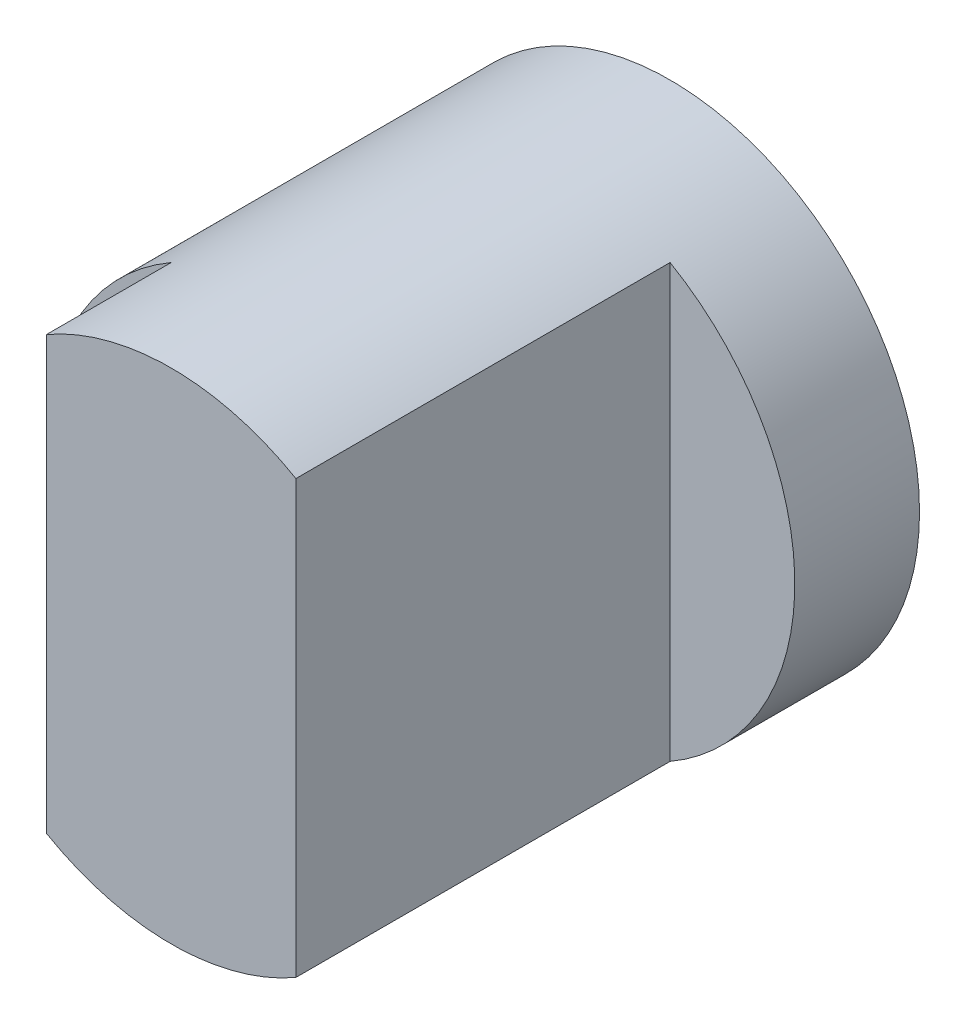
ISO-10303-21;
HEADER;
FILE_DESCRIPTION(('STEP AP214'),'2;1');
FILE_NAME('part.step','',(''),(''),'','','');
FILE_SCHEMA(('AUTOMOTIVE_DESIGN { 1 0 10303 214 1 1 1 1 }'));
ENDSEC;
DATA;
#1=APPLICATION_CONTEXT('core data for automotive mechanical design processes');
#2=APPLICATION_PROTOCOL_DEFINITION('international standard','automotive_design',2000,#1);
#3=PRODUCT_CONTEXT('',#1,'mechanical');
#4=PRODUCT('Part','Part','',(#3));
#5=PRODUCT_RELATED_PRODUCT_CATEGORY('part','',(#4));
#6=PRODUCT_DEFINITION_FORMATION('','',#4);
#7=PRODUCT_DEFINITION_CONTEXT('part definition',#1,'design');
#8=PRODUCT_DEFINITION('design','',#6,#7);
#9=PRODUCT_DEFINITION_SHAPE('','',#8);
#10=(LENGTH_UNIT() NAMED_UNIT(*) SI_UNIT(.MILLI.,.METRE.));
#11=(NAMED_UNIT(*) PLANE_ANGLE_UNIT() SI_UNIT($,.RADIAN.));
#12=(NAMED_UNIT(*) SI_UNIT($,.STERADIAN.) SOLID_ANGLE_UNIT());
#13=UNCERTAINTY_MEASURE_WITH_UNIT(LENGTH_MEASURE(1.E-05),#10,'distance_accuracy_value','');
#14=(GEOMETRIC_REPRESENTATION_CONTEXT(3) GLOBAL_UNCERTAINTY_ASSIGNED_CONTEXT((#13)) GLOBAL_UNIT_ASSIGNED_CONTEXT((#10,
#11,#12)) REPRESENTATION_CONTEXT('',''));
#15=CARTESIAN_POINT('',(0.,0.,0.));
#16=DIRECTION('',(0.,0.,1.));
#17=DIRECTION('',(1.,0.,0.));
#18=AXIS2_PLACEMENT_3D('',#15,#16,#17);
#19=CARTESIAN_POINT('',(0.,0.,4.));
#20=DIRECTION('',(0.,0.,-1.));
#21=DIRECTION('',(-1.,0.,0.));
#22=AXIS2_PLACEMENT_3D('',#19,#20,#21);
#23=CYLINDRICAL_SURFACE('',#22,2.);
#24=CARTESIAN_POINT('',(0.,0.,4.));
#25=DIRECTION('',(0.,0.,1.));
#26=DIRECTION('',(1.,0.,0.));
#27=AXIS2_PLACEMENT_3D('',#24,#25,#26);
#28=CIRCLE('',#27,2.);
#29=CARTESIAN_POINT('',(1.,1.73205080756888,4.));
#30=VERTEX_POINT('',#29);
#31=CARTESIAN_POINT('',(-1.,1.73205080756888,4.));
#32=VERTEX_POINT('',#31);
#33=EDGE_CURVE('E82',#30,#32,#28,.T.);
#34=ORIENTED_EDGE('',*,*,#33,.F.);
#35=DIRECTION('',(0.,0.,-1.));
#36=VECTOR('',#35,1.);
#37=CARTESIAN_POINT('',(1.,1.73205080756888,4.));
#38=LINE('',#37,#36);
#39=CARTESIAN_POINT('',(1.,1.73205080756888,1.));
#40=VERTEX_POINT('',#39);
#41=EDGE_CURVE('E55',#30,#40,#38,.T.);
#42=ORIENTED_EDGE('',*,*,#41,.T.);
#43=CARTESIAN_POINT('',(0.,0.,1.));
#44=DIRECTION('',(0.,0.,-1.));
#45=DIRECTION('',(-1.,0.,0.));
#46=AXIS2_PLACEMENT_3D('',#43,#44,#45);
#47=CIRCLE('',#46,2.);
#48=CARTESIAN_POINT('',(1.,-1.73205080756888,1.));
#49=VERTEX_POINT('',#48);
#50=EDGE_CURVE('E11',#40,#49,#47,.T.);
#51=ORIENTED_EDGE('',*,*,#50,.T.);
#52=DIRECTION('',(0.,0.,-1.));
#53=VECTOR('',#52,1.);
#54=CARTESIAN_POINT('',(1.,-1.73205080756888,4.));
#55=LINE('',#54,#53);
#56=CARTESIAN_POINT('',(1.,-1.73205080756888,4.));
#57=VERTEX_POINT('',#56);
#58=EDGE_CURVE('E101',#49,#57,#55,.F.);
#59=ORIENTED_EDGE('',*,*,#58,.T.);
#60=CARTESIAN_POINT('',(-1.,-1.73205080756888,4.));
#61=VERTEX_POINT('',#60);
#62=EDGE_CURVE('E91',#61,#57,#28,.T.);
#63=ORIENTED_EDGE('',*,*,#62,.F.);
#64=DIRECTION('',(0.,0.,-1.));
#65=VECTOR('',#64,1.);
#66=CARTESIAN_POINT('',(-1.,-1.73205080756888,4.));
#67=LINE('',#66,#65);
#68=CARTESIAN_POINT('',(-1.,-1.73205080756888,3.));
#69=VERTEX_POINT('',#68);
#70=EDGE_CURVE('E47',#61,#69,#67,.T.);
#71=ORIENTED_EDGE('',*,*,#70,.T.);
#72=CARTESIAN_POINT('',(0.,0.,3.));
#73=DIRECTION('',(0.,0.,-1.));
#74=DIRECTION('',(-1.,0.,0.));
#75=AXIS2_PLACEMENT_3D('',#72,#73,#74);
#76=CIRCLE('',#75,2.);
#77=CARTESIAN_POINT('',(-1.,1.73205080756888,3.));
#78=VERTEX_POINT('',#77);
#79=EDGE_CURVE('E40',#69,#78,#76,.T.);
#80=ORIENTED_EDGE('',*,*,#79,.T.);
#81=DIRECTION('',(0.,0.,-1.));
#82=VECTOR('',#81,1.);
#83=CARTESIAN_POINT('',(-1.,1.73205080756888,4.));
#84=LINE('',#83,#82);
#85=EDGE_CURVE('E75',#78,#32,#84,.F.);
#86=ORIENTED_EDGE('',*,*,#85,.T.);
#87=EDGE_LOOP('',(#34,#42,#51,#59,#63,#71,#80,#86));
#88=FACE_BOUND('',#87,.T.);
#89=CARTESIAN_POINT('',(0.,0.,0.));
#90=DIRECTION('',(0.,0.,1.));
#91=DIRECTION('',(1.,0.,0.));
#92=AXIS2_PLACEMENT_3D('',#89,#90,#91);
#93=CIRCLE('',#92,2.);
#94=CARTESIAN_POINT('',(2.,0.,0.));
#95=VERTEX_POINT('',#94);
#96=EDGE_CURVE('E93',#95,#95,#93,.T.);
#97=ORIENTED_EDGE('',*,*,#96,.T.);
#98=EDGE_LOOP('',(#97));
#99=FACE_BOUND('',#98,.T.);
#100=ADVANCED_FACE('F33',(#88,#99),#23,.T.);
#101=CARTESIAN_POINT('',(0.,0.,4.));
#102=DIRECTION('',(0.,0.,1.));
#103=DIRECTION('',(1.,0.,0.));
#104=AXIS2_PLACEMENT_3D('',#101,#102,#103);
#105=PLANE('',#104);
#106=DIRECTION('',(0.,-1.,0.));
#107=VECTOR('',#106,1.);
#108=CARTESIAN_POINT('',(1.,0.,4.));
#109=LINE('',#108,#107);
#110=EDGE_CURVE('E81',#30,#57,#109,.T.);
#111=ORIENTED_EDGE('',*,*,#110,.F.);
#112=ORIENTED_EDGE('',*,*,#33,.T.);
#113=DIRECTION('',(0.,1.,0.));
#114=VECTOR('',#113,1.);
#115=CARTESIAN_POINT('',(-1.,0.,4.));
#116=LINE('',#115,#114);
#117=EDGE_CURVE('E72',#61,#32,#116,.T.);
#118=ORIENTED_EDGE('',*,*,#117,.F.);
#119=ORIENTED_EDGE('',*,*,#62,.T.);
#120=EDGE_LOOP('',(#111,#112,#118,#119));
#121=FACE_BOUND('',#120,.T.);
#122=ADVANCED_FACE('F90',(#121),#105,.T.);
#123=CARTESIAN_POINT('',(0.,0.,0.));
#124=DIRECTION('',(0.,0.,1.));
#125=DIRECTION('',(1.,0.,0.));
#126=AXIS2_PLACEMENT_3D('',#123,#124,#125);
#127=PLANE('',#126);
#128=ORIENTED_EDGE('',*,*,#96,.F.);
#129=EDGE_LOOP('',(#128));
#130=FACE_BOUND('',#129,.T.);
#131=ADVANCED_FACE('F124',(#130),#127,.F.);
#132=CARTESIAN_POINT('',(-2.,-5.,3.));
#133=DIRECTION('',(0.,0.,-1.));
#134=DIRECTION('',(-1.,0.,0.));
#135=AXIS2_PLACEMENT_3D('',#132,#133,#134);
#136=PLANE('',#135);
#137=ORIENTED_EDGE('',*,*,#79,.F.);
#138=DIRECTION('',(0.,1.,0.));
#139=VECTOR('',#138,1.);
#140=CARTESIAN_POINT('',(-1.,-5.,3.));
#141=LINE('',#140,#139);
#142=EDGE_CURVE('E105',#69,#78,#141,.T.);
#143=ORIENTED_EDGE('',*,*,#142,.T.);
#144=EDGE_LOOP('',(#137,#143));
#145=FACE_BOUND('',#144,.T.);
#146=ADVANCED_FACE('F116',(#145),#136,.F.);
#147=CARTESIAN_POINT('',(-1.,-5.,4.));
#148=DIRECTION('',(1.,0.,0.));
#149=DIRECTION('',(0.,0.,-1.));
#150=AXIS2_PLACEMENT_3D('',#147,#148,#149);
#151=PLANE('',#150);
#152=ORIENTED_EDGE('',*,*,#117,.T.);
#153=ORIENTED_EDGE('',*,*,#85,.F.);
#154=ORIENTED_EDGE('',*,*,#142,.F.);
#155=ORIENTED_EDGE('',*,*,#70,.F.);
#156=EDGE_LOOP('',(#152,#153,#154,#155));
#157=FACE_BOUND('',#156,.T.);
#158=ADVANCED_FACE('F74',(#157),#151,.F.);
#159=CARTESIAN_POINT('',(2.,-5.,1.));
#160=DIRECTION('',(0.,0.,-1.));
#161=DIRECTION('',(-1.,0.,0.));
#162=AXIS2_PLACEMENT_3D('',#159,#160,#161);
#163=PLANE('',#162);
#164=DIRECTION('',(0.,1.,0.));
#165=VECTOR('',#164,1.);
#166=CARTESIAN_POINT('',(1.,-5.,1.));
#167=LINE('',#166,#165);
#168=EDGE_CURVE('E88',#49,#40,#167,.T.);
#169=ORIENTED_EDGE('',*,*,#168,.F.);
#170=ORIENTED_EDGE('',*,*,#50,.F.);
#171=EDGE_LOOP('',(#169,#170));
#172=FACE_BOUND('',#171,.T.);
#173=ADVANCED_FACE('F108',(#172),#163,.F.);
#174=CARTESIAN_POINT('',(1.,-5.,4.));
#175=DIRECTION('',(-1.,0.,0.));
#176=DIRECTION('',(0.,0.,1.));
#177=AXIS2_PLACEMENT_3D('',#174,#175,#176);
#178=PLANE('',#177);
#179=ORIENTED_EDGE('',*,*,#110,.T.);
#180=ORIENTED_EDGE('',*,*,#58,.F.);
#181=ORIENTED_EDGE('',*,*,#168,.T.);
#182=ORIENTED_EDGE('',*,*,#41,.F.);
#183=EDGE_LOOP('',(#179,#180,#181,#182));
#184=FACE_BOUND('',#183,.T.);
#185=ADVANCED_FACE('F100',(#184),#178,.F.);
#186=CLOSED_SHELL('',(#100,#122,#131,#146,#158,#173,#185));
#187=MANIFOLD_SOLID_BREP('B2',#186);
#188=ADVANCED_BREP_SHAPE_REPRESENTATION('',(#18,#187),#14);
#189=SHAPE_DEFINITION_REPRESENTATION(#9,#188);
ENDSEC;
END-ISO-10303-21;
